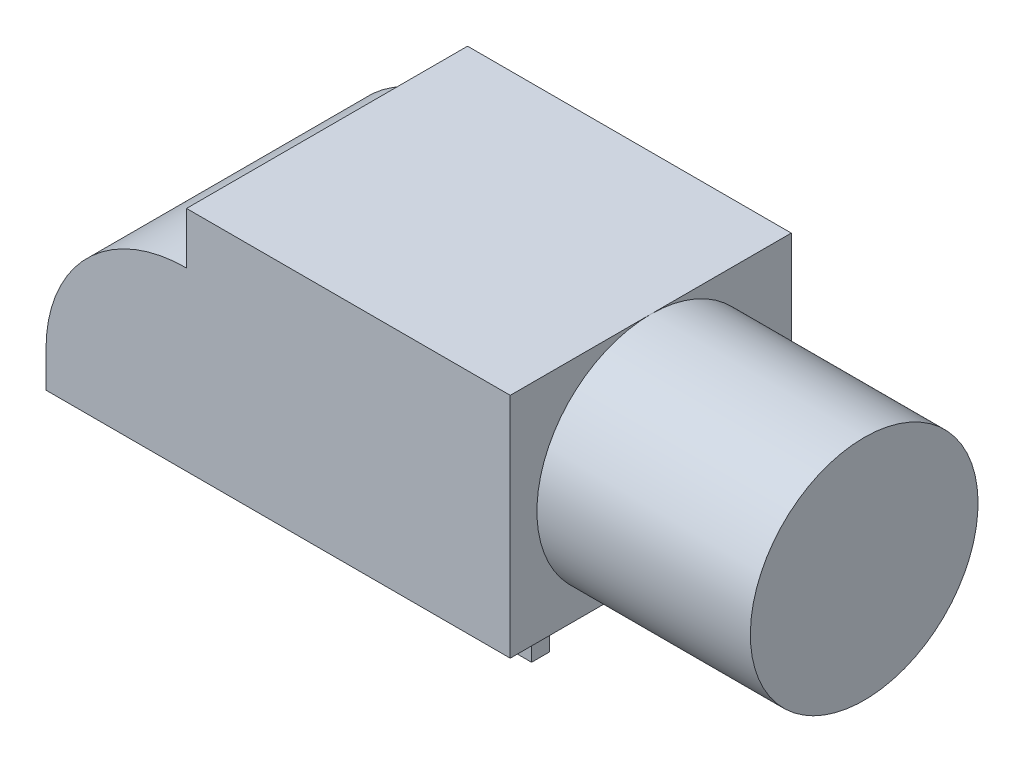
ISO-10303-21;
HEADER;
FILE_DESCRIPTION(('STEP AP214'),'2;1');
FILE_NAME('part.step','',(''),(''),'','','');
FILE_SCHEMA(('AUTOMOTIVE_DESIGN { 1 0 10303 214 1 1 1 1 }'));
ENDSEC;
DATA;
#1=APPLICATION_CONTEXT('core data for automotive mechanical design processes');
#2=APPLICATION_PROTOCOL_DEFINITION('international standard','automotive_design',2000,#1);
#3=PRODUCT_CONTEXT('',#1,'mechanical');
#4=PRODUCT('Part','Part','',(#3));
#5=PRODUCT_RELATED_PRODUCT_CATEGORY('part','',(#4));
#6=PRODUCT_DEFINITION_FORMATION('','',#4);
#7=PRODUCT_DEFINITION_CONTEXT('part definition',#1,'design');
#8=PRODUCT_DEFINITION('design','',#6,#7);
#9=PRODUCT_DEFINITION_SHAPE('','',#8);
#10=(LENGTH_UNIT() NAMED_UNIT(*) SI_UNIT(.MILLI.,.METRE.));
#11=(NAMED_UNIT(*) PLANE_ANGLE_UNIT() SI_UNIT($,.RADIAN.));
#12=(NAMED_UNIT(*) SI_UNIT($,.STERADIAN.) SOLID_ANGLE_UNIT());
#13=UNCERTAINTY_MEASURE_WITH_UNIT(LENGTH_MEASURE(1.E-05),#10,'distance_accuracy_value','');
#14=(GEOMETRIC_REPRESENTATION_CONTEXT(3) GLOBAL_UNCERTAINTY_ASSIGNED_CONTEXT((#13)) GLOBAL_UNIT_ASSIGNED_CONTEXT((#10,
#11,#12)) REPRESENTATION_CONTEXT('',''));
#15=CARTESIAN_POINT('',(0.,0.,0.));
#16=DIRECTION('',(0.,0.,1.));
#17=DIRECTION('',(1.,0.,0.));
#18=AXIS2_PLACEMENT_3D('',#15,#16,#17);
#19=CARTESIAN_POINT('',(-9.525,-3.2,3.95));
#20=DIRECTION('',(0.,1.,0.));
#21=DIRECTION('',(0.,0.,1.));
#22=AXIS2_PLACEMENT_3D('',#19,#20,#21);
#23=PLANE('',#22);
#24=CARTESIAN_POINT('',(-7.875,-3.2,0.));
#25=DIRECTION('',(0.,1.,0.));
#26=DIRECTION('',(0.,0.,1.));
#27=AXIS2_PLACEMENT_3D('',#24,#25,#26);
#28=CIRCLE('',#27,0.75);
#29=CARTESIAN_POINT('',(-7.875,-3.2,0.75));
#30=VERTEX_POINT('',#29);
#31=EDGE_CURVE('E149',#30,#30,#28,.F.);
#32=ORIENTED_EDGE('',*,*,#31,.F.);
#33=EDGE_LOOP('',(#32));
#34=FACE_BOUND('',#33,.T.);
#35=DIRECTION('',(0.,0.,1.));
#36=VECTOR('',#35,1.);
#37=CARTESIAN_POINT('',(2.925,-3.2,2.75));
#38=LINE('',#37,#36);
#39=CARTESIAN_POINT('',(2.925,-3.2,2.25));
#40=VERTEX_POINT('',#39);
#41=CARTESIAN_POINT('',(2.925,-3.2,2.75));
#42=VERTEX_POINT('',#41);
#43=EDGE_CURVE('E193',#40,#42,#38,.T.);
#44=ORIENTED_EDGE('',*,*,#43,.F.);
#45=DIRECTION('',(1.,0.,0.));
#46=VECTOR('',#45,1.);
#47=CARTESIAN_POINT('',(1.725,-3.2,2.25));
#48=LINE('',#47,#46);
#49=CARTESIAN_POINT('',(1.725,-3.2,2.25));
#50=VERTEX_POINT('',#49);
#51=EDGE_CURVE('E238',#50,#40,#48,.T.);
#52=ORIENTED_EDGE('',*,*,#51,.F.);
#53=DIRECTION('',(0.,0.,-1.));
#54=VECTOR('',#53,1.);
#55=CARTESIAN_POINT('',(1.725,-3.2,2.75));
#56=LINE('',#55,#54);
#57=CARTESIAN_POINT('',(1.725,-3.2,2.75));
#58=VERTEX_POINT('',#57);
#59=EDGE_CURVE('E249',#58,#50,#56,.T.);
#60=ORIENTED_EDGE('',*,*,#59,.F.);
#61=DIRECTION('',(-1.,0.,0.));
#62=VECTOR('',#61,1.);
#63=CARTESIAN_POINT('',(1.725,-3.2,2.75));
#64=LINE('',#63,#62);
#65=EDGE_CURVE('E246',#42,#58,#64,.T.);
#66=ORIENTED_EDGE('',*,*,#65,.F.);
#67=EDGE_LOOP('',(#44,#52,#60,#66));
#68=FACE_BOUND('',#67,.T.);
#69=DIRECTION('',(0.,0.,-1.));
#70=VECTOR('',#69,1.);
#71=CARTESIAN_POINT('',(3.525,-3.2,3.95));
#72=LINE('',#71,#70);
#73=CARTESIAN_POINT('',(3.525,-3.2,3.95));
#74=VERTEX_POINT('',#73);
#75=CARTESIAN_POINT('',(3.525,-3.2,0.));
#76=VERTEX_POINT('',#75);
#77=EDGE_CURVE('E197',#74,#76,#72,.T.);
#78=ORIENTED_EDGE('',*,*,#77,.F.);
#79=DIRECTION('',(1.,0.,0.));
#80=VECTOR('',#79,1.);
#81=CARTESIAN_POINT('',(-9.525,-3.2,3.95));
#82=LINE('',#81,#80);
#83=CARTESIAN_POINT('',(-9.525,-3.2,3.95));
#84=VERTEX_POINT('',#83);
#85=EDGE_CURVE('E164',#84,#74,#82,.T.);
#86=ORIENTED_EDGE('',*,*,#85,.F.);
#87=DIRECTION('',(0.,0.,-1.));
#88=VECTOR('',#87,1.);
#89=CARTESIAN_POINT('',(-9.525,-3.2,3.95));
#90=LINE('',#89,#88);
#91=CARTESIAN_POINT('',(-9.525,-3.2,-3.95));
#92=VERTEX_POINT('',#91);
#93=EDGE_CURVE('E162',#84,#92,#90,.T.);
#94=ORIENTED_EDGE('',*,*,#93,.T.);
#95=DIRECTION('',(1.,0.,0.));
#96=VECTOR('',#95,1.);
#97=CARTESIAN_POINT('',(-9.525,-3.2,-3.95));
#98=LINE('',#97,#96);
#99=CARTESIAN_POINT('',(3.525,-3.2,-3.95));
#100=VERTEX_POINT('',#99);
#101=EDGE_CURVE('E168',#92,#100,#98,.T.);
#102=ORIENTED_EDGE('',*,*,#101,.T.);
#103=EDGE_CURVE('E268',#76,#100,#72,.T.);
#104=ORIENTED_EDGE('',*,*,#103,.F.);
#105=EDGE_LOOP('',(#78,#86,#94,#102,#104));
#106=FACE_BOUND('',#105,.T.);
#107=DIRECTION('',(0.,0.,1.));
#108=VECTOR('',#107,1.);
#109=CARTESIAN_POINT('',(2.925,-3.2,-2.25));
#110=LINE('',#109,#108);
#111=CARTESIAN_POINT('',(2.925,-3.2,-2.75));
#112=VERTEX_POINT('',#111);
#113=CARTESIAN_POINT('',(2.925,-3.2,-2.25));
#114=VERTEX_POINT('',#113);
#115=EDGE_CURVE('E199',#112,#114,#110,.T.);
#116=ORIENTED_EDGE('',*,*,#115,.F.);
#117=DIRECTION('',(1.,0.,0.));
#118=VECTOR('',#117,1.);
#119=CARTESIAN_POINT('',(1.725,-3.2,-2.75));
#120=LINE('',#119,#118);
#121=CARTESIAN_POINT('',(1.725,-3.2,-2.75));
#122=VERTEX_POINT('',#121);
#123=EDGE_CURVE('E201',#122,#112,#120,.T.);
#124=ORIENTED_EDGE('',*,*,#123,.F.);
#125=DIRECTION('',(0.,0.,-1.));
#126=VECTOR('',#125,1.);
#127=CARTESIAN_POINT('',(1.725,-3.2,-2.25));
#128=LINE('',#127,#126);
#129=CARTESIAN_POINT('',(1.725,-3.2,-2.25));
#130=VERTEX_POINT('',#129);
#131=EDGE_CURVE('E218',#130,#122,#128,.T.);
#132=ORIENTED_EDGE('',*,*,#131,.F.);
#133=DIRECTION('',(-1.,0.,0.));
#134=VECTOR('',#133,1.);
#135=CARTESIAN_POINT('',(1.725,-3.2,-2.25));
#136=LINE('',#135,#134);
#137=EDGE_CURVE('E60',#114,#130,#136,.T.);
#138=ORIENTED_EDGE('',*,*,#137,.F.);
#139=EDGE_LOOP('',(#116,#124,#132,#138));
#140=FACE_BOUND('',#139,.T.);
#141=ADVANCED_FACE('F37',(#34,#68,#106,#140),#23,.F.);
#142=CARTESIAN_POINT('',(-9.525,3.2,3.95));
#143=DIRECTION('',(0.,-1.,0.));
#144=DIRECTION('',(0.,0.,-1.));
#145=AXIS2_PLACEMENT_3D('',#142,#143,#144);
#146=PLANE('',#145);
#147=DIRECTION('',(-1.,0.,0.));
#148=VECTOR('',#147,1.);
#149=CARTESIAN_POINT('',(-9.525,3.2,-3.95));
#150=LINE('',#149,#148);
#151=CARTESIAN_POINT('',(3.525,3.2,-3.95));
#152=VERTEX_POINT('',#151);
#153=CARTESIAN_POINT('',(-5.575,3.2,-3.95));
#154=VERTEX_POINT('',#153);
#155=EDGE_CURVE('E172',#152,#154,#150,.T.);
#156=ORIENTED_EDGE('',*,*,#155,.T.);
#157=DIRECTION('',(0.,0.,-1.));
#158=VECTOR('',#157,1.);
#159=CARTESIAN_POINT('',(-5.575,3.2,31.3381960203661));
#160=LINE('',#159,#158);
#161=CARTESIAN_POINT('',(-5.575,3.2,3.95));
#162=VERTEX_POINT('',#161);
#163=EDGE_CURVE('E285',#162,#154,#160,.T.);
#164=ORIENTED_EDGE('',*,*,#163,.F.);
#165=DIRECTION('',(-1.,0.,0.));
#166=VECTOR('',#165,1.);
#167=CARTESIAN_POINT('',(-9.525,3.2,3.95));
#168=LINE('',#167,#166);
#169=CARTESIAN_POINT('',(3.525,3.2,3.95));
#170=VERTEX_POINT('',#169);
#171=EDGE_CURVE('E165',#170,#162,#168,.T.);
#172=ORIENTED_EDGE('',*,*,#171,.F.);
#173=DIRECTION('',(0.,0.,1.));
#174=VECTOR('',#173,1.);
#175=CARTESIAN_POINT('',(3.525,3.2,3.95));
#176=LINE('',#175,#174);
#177=CARTESIAN_POINT('',(3.525,3.2,0.));
#178=VERTEX_POINT('',#177);
#179=EDGE_CURVE('E176',#178,#170,#176,.T.);
#180=ORIENTED_EDGE('',*,*,#179,.F.);
#181=EDGE_CURVE('E273',#152,#178,#176,.T.);
#182=ORIENTED_EDGE('',*,*,#181,.F.);
#183=EDGE_LOOP('',(#156,#164,#172,#180,#182));
#184=FACE_BOUND('',#183,.T.);
#185=ADVANCED_FACE('F189',(#184),#146,.F.);
#186=CARTESIAN_POINT('',(0.,0.,3.95));
#187=DIRECTION('',(0.,0.,1.));
#188=DIRECTION('',(1.,0.,0.));
#189=AXIS2_PLACEMENT_3D('',#186,#187,#188);
#190=PLANE('',#189);
#191=DIRECTION('',(0.,1.,0.));
#192=VECTOR('',#191,1.);
#193=CARTESIAN_POINT('',(-5.575,0.,3.95));
#194=LINE('',#193,#192);
#195=CARTESIAN_POINT('',(-5.575,1.75,3.95));
#196=VERTEX_POINT('',#195);
#197=EDGE_CURVE('E158',#196,#162,#194,.T.);
#198=ORIENTED_EDGE('',*,*,#197,.F.);
#199=CARTESIAN_POINT('',(-5.575,-2.2,3.95));
#200=DIRECTION('',(0.,0.,1.));
#201=DIRECTION('',(1.,0.,0.));
#202=AXIS2_PLACEMENT_3D('',#199,#200,#201);
#203=CIRCLE('',#202,3.95);
#204=CARTESIAN_POINT('',(-9.525,-2.2,3.95));
#205=VERTEX_POINT('',#204);
#206=EDGE_CURVE('E144',#205,#196,#203,.F.);
#207=ORIENTED_EDGE('',*,*,#206,.F.);
#208=DIRECTION('',(0.,-1.,0.));
#209=VECTOR('',#208,1.);
#210=CARTESIAN_POINT('',(-9.525,3.2,3.95));
#211=LINE('',#210,#209);
#212=EDGE_CURVE('E155',#205,#84,#211,.T.);
#213=ORIENTED_EDGE('',*,*,#212,.T.);
#214=ORIENTED_EDGE('',*,*,#85,.T.);
#215=DIRECTION('',(0.,1.,0.));
#216=VECTOR('',#215,1.);
#217=CARTESIAN_POINT('',(3.525,0.,3.95));
#218=LINE('',#217,#216);
#219=EDGE_CURVE('E274',#74,#170,#218,.T.);
#220=ORIENTED_EDGE('',*,*,#219,.T.);
#221=ORIENTED_EDGE('',*,*,#171,.T.);
#222=EDGE_LOOP('',(#198,#207,#213,#214,#220,#221));
#223=FACE_BOUND('',#222,.T.);
#224=ADVANCED_FACE('F153',(#223),#190,.T.);
#225=CARTESIAN_POINT('',(0.,0.,-3.95));
#226=DIRECTION('',(0.,0.,1.));
#227=DIRECTION('',(1.,0.,0.));
#228=AXIS2_PLACEMENT_3D('',#225,#226,#227);
#229=PLANE('',#228);
#230=CARTESIAN_POINT('',(-5.575,-2.2,-3.95));
#231=DIRECTION('',(0.,0.,1.));
#232=DIRECTION('',(1.,0.,0.));
#233=AXIS2_PLACEMENT_3D('',#230,#231,#232);
#234=CIRCLE('',#233,3.95);
#235=CARTESIAN_POINT('',(-9.525,-2.2,-3.95));
#236=VERTEX_POINT('',#235);
#237=CARTESIAN_POINT('',(-5.575,1.75,-3.95));
#238=VERTEX_POINT('',#237);
#239=EDGE_CURVE('E52',#236,#238,#234,.F.);
#240=ORIENTED_EDGE('',*,*,#239,.T.);
#241=DIRECTION('',(0.,1.,0.));
#242=VECTOR('',#241,1.);
#243=CARTESIAN_POINT('',(-5.575,0.,-3.95));
#244=LINE('',#243,#242);
#245=EDGE_CURVE('E12',#238,#154,#244,.T.);
#246=ORIENTED_EDGE('',*,*,#245,.T.);
#247=ORIENTED_EDGE('',*,*,#155,.F.);
#248=DIRECTION('',(0.,1.,0.));
#249=VECTOR('',#248,1.);
#250=CARTESIAN_POINT('',(3.525,0.,-3.95));
#251=LINE('',#250,#249);
#252=EDGE_CURVE('E181',#100,#152,#251,.T.);
#253=ORIENTED_EDGE('',*,*,#252,.F.);
#254=ORIENTED_EDGE('',*,*,#101,.F.);
#255=DIRECTION('',(0.,-1.,0.));
#256=VECTOR('',#255,1.);
#257=CARTESIAN_POINT('',(-9.525,3.2,-3.95));
#258=LINE('',#257,#256);
#259=EDGE_CURVE('E175',#236,#92,#258,.T.);
#260=ORIENTED_EDGE('',*,*,#259,.F.);
#261=EDGE_LOOP('',(#240,#246,#247,#253,#254,#260));
#262=FACE_BOUND('',#261,.T.);
#263=ADVANCED_FACE('F354',(#262),#229,.F.);
#264=CARTESIAN_POINT('',(-9.525,3.2,3.95));
#265=DIRECTION('',(1.,0.,0.));
#266=DIRECTION('',(0.,0.,-1.));
#267=AXIS2_PLACEMENT_3D('',#264,#265,#266);
#268=PLANE('',#267);
#269=ORIENTED_EDGE('',*,*,#212,.F.);
#270=DIRECTION('',(0.,0.,-1.));
#271=VECTOR('',#270,1.);
#272=CARTESIAN_POINT('',(-9.525,-2.2,31.3381960203661));
#273=LINE('',#272,#271);
#274=EDGE_CURVE('E45',#205,#236,#273,.T.);
#275=ORIENTED_EDGE('',*,*,#274,.T.);
#276=ORIENTED_EDGE('',*,*,#259,.T.);
#277=ORIENTED_EDGE('',*,*,#93,.F.);
#278=EDGE_LOOP('',(#269,#275,#276,#277));
#279=FACE_BOUND('',#278,.T.);
#280=ADVANCED_FACE('F160',(#279),#268,.F.);
#281=CARTESIAN_POINT('',(3.525,0.,0.));
#282=DIRECTION('',(1.,0.,0.));
#283=DIRECTION('',(0.,1.,0.));
#284=AXIS2_PLACEMENT_3D('',#281,#282,#283);
#285=CYLINDRICAL_SURFACE('',#284,3.2);
#286=CARTESIAN_POINT('',(9.525,0.,0.));
#287=DIRECTION('',(1.,0.,0.));
#288=DIRECTION('',(0.,1.,0.));
#289=AXIS2_PLACEMENT_3D('',#286,#287,#288);
#290=CIRCLE('',#289,3.2);
#291=CARTESIAN_POINT('',(9.525,3.2,0.));
#292=VERTEX_POINT('',#291);
#293=EDGE_CURVE('E264',#292,#292,#290,.T.);
#294=ORIENTED_EDGE('',*,*,#293,.F.);
#295=EDGE_LOOP('',(#294));
#296=FACE_BOUND('',#295,.T.);
#297=CARTESIAN_POINT('',(3.525,0.,0.));
#298=DIRECTION('',(1.,0.,0.));
#299=DIRECTION('',(0.,1.,0.));
#300=AXIS2_PLACEMENT_3D('',#297,#298,#299);
#301=CIRCLE('',#300,3.2);
#302=EDGE_CURVE('E269',#76,#178,#301,.T.);
#303=ORIENTED_EDGE('',*,*,#302,.T.);
#304=EDGE_CURVE('E265',#178,#76,#301,.T.);
#305=ORIENTED_EDGE('',*,*,#304,.T.);
#306=EDGE_LOOP('',(#303,#305));
#307=FACE_BOUND('',#306,.T.);
#308=ADVANCED_FACE('F345',(#296,#307),#285,.T.);
#309=CARTESIAN_POINT('',(3.525,0.,0.));
#310=DIRECTION('',(1.,0.,0.));
#311=DIRECTION('',(0.,1.,0.));
#312=AXIS2_PLACEMENT_3D('',#309,#310,#311);
#313=PLANE('',#312);
#314=ORIENTED_EDGE('',*,*,#179,.T.);
#315=ORIENTED_EDGE('',*,*,#219,.F.);
#316=ORIENTED_EDGE('',*,*,#77,.T.);
#317=ORIENTED_EDGE('',*,*,#304,.F.);
#318=EDGE_LOOP('',(#314,#315,#316,#317));
#319=FACE_BOUND('',#318,.T.);
#320=ADVANCED_FACE('F280',(#319),#313,.T.);
#321=ORIENTED_EDGE('',*,*,#181,.T.);
#322=ORIENTED_EDGE('',*,*,#302,.F.);
#323=ORIENTED_EDGE('',*,*,#103,.T.);
#324=ORIENTED_EDGE('',*,*,#252,.T.);
#325=EDGE_LOOP('',(#321,#322,#323,#324));
#326=FACE_BOUND('',#325,.T.);
#327=ADVANCED_FACE('F351',(#326),#313,.T.);
#328=CARTESIAN_POINT('',(9.525,3.2,3.95));
#329=DIRECTION('',(-1.,0.,0.));
#330=DIRECTION('',(0.,0.,1.));
#331=AXIS2_PLACEMENT_3D('',#328,#329,#330);
#332=PLANE('',#331);
#333=ORIENTED_EDGE('',*,*,#293,.T.);
#334=EDGE_LOOP('',(#333));
#335=FACE_BOUND('',#334,.T.);
#336=ADVANCED_FACE('F39',(#335),#332,.F.);
#337=CARTESIAN_POINT('',(2.925,-4.2,2.75));
#338=DIRECTION('',(-1.,0.,0.));
#339=DIRECTION('',(0.,0.,1.));
#340=AXIS2_PLACEMENT_3D('',#337,#338,#339);
#341=PLANE('',#340);
#342=ORIENTED_EDGE('',*,*,#43,.T.);
#343=DIRECTION('',(0.,1.,0.));
#344=VECTOR('',#343,1.);
#345=CARTESIAN_POINT('',(2.925,-4.2,2.75));
#346=LINE('',#345,#344);
#347=CARTESIAN_POINT('',(2.925,-4.2,2.75));
#348=VERTEX_POINT('',#347);
#349=EDGE_CURVE('E261',#348,#42,#346,.T.);
#350=ORIENTED_EDGE('',*,*,#349,.F.);
#351=DIRECTION('',(0.,0.,1.));
#352=VECTOR('',#351,1.);
#353=CARTESIAN_POINT('',(2.925,-4.2,2.75));
#354=LINE('',#353,#352);
#355=CARTESIAN_POINT('',(2.925,-4.2,2.25));
#356=VERTEX_POINT('',#355);
#357=EDGE_CURVE('E234',#356,#348,#354,.T.);
#358=ORIENTED_EDGE('',*,*,#357,.F.);
#359=DIRECTION('',(0.,1.,0.));
#360=VECTOR('',#359,1.);
#361=CARTESIAN_POINT('',(2.925,-4.2,2.25));
#362=LINE('',#361,#360);
#363=EDGE_CURVE('E244',#356,#40,#362,.T.);
#364=ORIENTED_EDGE('',*,*,#363,.T.);
#365=EDGE_LOOP('',(#342,#350,#358,#364));
#366=FACE_BOUND('',#365,.T.);
#367=ADVANCED_FACE('F340',(#366),#341,.F.);
#368=CARTESIAN_POINT('',(1.725,-4.2,2.75));
#369=DIRECTION('',(0.,0.,-1.));
#370=DIRECTION('',(-1.,0.,0.));
#371=AXIS2_PLACEMENT_3D('',#368,#369,#370);
#372=PLANE('',#371);
#373=ORIENTED_EDGE('',*,*,#65,.T.);
#374=DIRECTION('',(0.,1.,0.));
#375=VECTOR('',#374,1.);
#376=CARTESIAN_POINT('',(1.725,-4.2,2.75));
#377=LINE('',#376,#375);
#378=CARTESIAN_POINT('',(1.725,-4.2,2.75));
#379=VERTEX_POINT('',#378);
#380=EDGE_CURVE('E258',#379,#58,#377,.T.);
#381=ORIENTED_EDGE('',*,*,#380,.F.);
#382=DIRECTION('',(-1.,0.,0.));
#383=VECTOR('',#382,1.);
#384=CARTESIAN_POINT('',(1.725,-4.2,2.75));
#385=LINE('',#384,#383);
#386=EDGE_CURVE('E237',#348,#379,#385,.T.);
#387=ORIENTED_EDGE('',*,*,#386,.F.);
#388=ORIENTED_EDGE('',*,*,#349,.T.);
#389=EDGE_LOOP('',(#373,#381,#387,#388));
#390=FACE_BOUND('',#389,.T.);
#391=ADVANCED_FACE('F336',(#390),#372,.F.);
#392=CARTESIAN_POINT('',(1.725,-4.2,2.75));
#393=DIRECTION('',(1.,0.,0.));
#394=DIRECTION('',(0.,0.,-1.));
#395=AXIS2_PLACEMENT_3D('',#392,#393,#394);
#396=PLANE('',#395);
#397=ORIENTED_EDGE('',*,*,#59,.T.);
#398=DIRECTION('',(0.,1.,0.));
#399=VECTOR('',#398,1.);
#400=CARTESIAN_POINT('',(1.725,-4.2,2.25));
#401=LINE('',#400,#399);
#402=CARTESIAN_POINT('',(1.725,-4.2,2.25));
#403=VERTEX_POINT('',#402);
#404=EDGE_CURVE('E255',#403,#50,#401,.T.);
#405=ORIENTED_EDGE('',*,*,#404,.F.);
#406=DIRECTION('',(0.,0.,-1.));
#407=VECTOR('',#406,1.);
#408=CARTESIAN_POINT('',(1.725,-4.2,2.75));
#409=LINE('',#408,#407);
#410=EDGE_CURVE('E240',#379,#403,#409,.T.);
#411=ORIENTED_EDGE('',*,*,#410,.F.);
#412=ORIENTED_EDGE('',*,*,#380,.T.);
#413=EDGE_LOOP('',(#397,#405,#411,#412));
#414=FACE_BOUND('',#413,.T.);
#415=ADVANCED_FACE('F332',(#414),#396,.F.);
#416=CARTESIAN_POINT('',(1.725,-4.2,2.25));
#417=DIRECTION('',(0.,0.,1.));
#418=DIRECTION('',(1.,0.,0.));
#419=AXIS2_PLACEMENT_3D('',#416,#417,#418);
#420=PLANE('',#419);
#421=ORIENTED_EDGE('',*,*,#51,.T.);
#422=ORIENTED_EDGE('',*,*,#363,.F.);
#423=DIRECTION('',(1.,0.,0.));
#424=VECTOR('',#423,1.);
#425=CARTESIAN_POINT('',(1.725,-4.2,2.25));
#426=LINE('',#425,#424);
#427=EDGE_CURVE('E242',#403,#356,#426,.T.);
#428=ORIENTED_EDGE('',*,*,#427,.F.);
#429=ORIENTED_EDGE('',*,*,#404,.T.);
#430=EDGE_LOOP('',(#421,#422,#428,#429));
#431=FACE_BOUND('',#430,.T.);
#432=ADVANCED_FACE('F328',(#431),#420,.F.);
#433=CARTESIAN_POINT('',(0.,-4.2,0.));
#434=DIRECTION('',(0.,-1.,0.));
#435=DIRECTION('',(0.,0.,-1.));
#436=AXIS2_PLACEMENT_3D('',#433,#434,#435);
#437=PLANE('',#436);
#438=ORIENTED_EDGE('',*,*,#357,.T.);
#439=ORIENTED_EDGE('',*,*,#386,.T.);
#440=ORIENTED_EDGE('',*,*,#410,.T.);
#441=ORIENTED_EDGE('',*,*,#427,.T.);
#442=EDGE_LOOP('',(#438,#439,#440,#441));
#443=FACE_BOUND('',#442,.T.);
#444=ADVANCED_FACE('F325',(#443),#437,.T.);
#445=CARTESIAN_POINT('',(2.925,-4.2,-2.25));
#446=DIRECTION('',(-1.,0.,0.));
#447=DIRECTION('',(0.,0.,1.));
#448=AXIS2_PLACEMENT_3D('',#445,#446,#447);
#449=PLANE('',#448);
#450=ORIENTED_EDGE('',*,*,#115,.T.);
#451=DIRECTION('',(0.,1.,0.));
#452=VECTOR('',#451,1.);
#453=CARTESIAN_POINT('',(2.925,-4.2,-2.25));
#454=LINE('',#453,#452);
#455=CARTESIAN_POINT('',(2.925,-4.2,-2.25));
#456=VERTEX_POINT('',#455);
#457=EDGE_CURVE('E232',#456,#114,#454,.T.);
#458=ORIENTED_EDGE('',*,*,#457,.F.);
#459=DIRECTION('',(0.,0.,1.));
#460=VECTOR('',#459,1.);
#461=CARTESIAN_POINT('',(2.925,-4.2,-2.25));
#462=LINE('',#461,#460);
#463=CARTESIAN_POINT('',(2.925,-4.2,-2.75));
#464=VERTEX_POINT('',#463);
#465=EDGE_CURVE('E217',#464,#456,#462,.T.);
#466=ORIENTED_EDGE('',*,*,#465,.F.);
#467=DIRECTION('',(0.,1.,0.));
#468=VECTOR('',#467,1.);
#469=CARTESIAN_POINT('',(2.925,-4.2,-2.75));
#470=LINE('',#469,#468);
#471=EDGE_CURVE('E213',#464,#112,#470,.T.);
#472=ORIENTED_EDGE('',*,*,#471,.T.);
#473=EDGE_LOOP('',(#450,#458,#466,#472));
#474=FACE_BOUND('',#473,.T.);
#475=ADVANCED_FACE('F220',(#474),#449,.F.);
#476=CARTESIAN_POINT('',(1.725,-4.2,-2.25));
#477=DIRECTION('',(0.,0.,-1.));
#478=DIRECTION('',(-1.,0.,0.));
#479=AXIS2_PLACEMENT_3D('',#476,#477,#478);
#480=PLANE('',#479);
#481=ORIENTED_EDGE('',*,*,#137,.T.);
#482=DIRECTION('',(0.,1.,0.));
#483=VECTOR('',#482,1.);
#484=CARTESIAN_POINT('',(1.725,-4.2,-2.25));
#485=LINE('',#484,#483);
#486=CARTESIAN_POINT('',(1.725,-4.2,-2.25));
#487=VERTEX_POINT('',#486);
#488=EDGE_CURVE('E224',#487,#130,#485,.T.);
#489=ORIENTED_EDGE('',*,*,#488,.F.);
#490=DIRECTION('',(-1.,0.,0.));
#491=VECTOR('',#490,1.);
#492=CARTESIAN_POINT('',(1.725,-4.2,-2.25));
#493=LINE('',#492,#491);
#494=EDGE_CURVE('E296',#456,#487,#493,.T.);
#495=ORIENTED_EDGE('',*,*,#494,.F.);
#496=ORIENTED_EDGE('',*,*,#457,.T.);
#497=EDGE_LOOP('',(#481,#489,#495,#496));
#498=FACE_BOUND('',#497,.T.);
#499=ADVANCED_FACE('F304',(#498),#480,.F.);
#500=CARTESIAN_POINT('',(1.725,-4.2,-2.25));
#501=DIRECTION('',(1.,0.,0.));
#502=DIRECTION('',(0.,0.,-1.));
#503=AXIS2_PLACEMENT_3D('',#500,#501,#502);
#504=PLANE('',#503);
#505=ORIENTED_EDGE('',*,*,#131,.T.);
#506=DIRECTION('',(0.,1.,0.));
#507=VECTOR('',#506,1.);
#508=CARTESIAN_POINT('',(1.725,-4.2,-2.75));
#509=LINE('',#508,#507);
#510=CARTESIAN_POINT('',(1.725,-4.2,-2.75));
#511=VERTEX_POINT('',#510);
#512=EDGE_CURVE('E216',#511,#122,#509,.T.);
#513=ORIENTED_EDGE('',*,*,#512,.F.);
#514=DIRECTION('',(0.,0.,-1.));
#515=VECTOR('',#514,1.);
#516=CARTESIAN_POINT('',(1.725,-4.2,-2.25));
#517=LINE('',#516,#515);
#518=EDGE_CURVE('E226',#487,#511,#517,.T.);
#519=ORIENTED_EDGE('',*,*,#518,.F.);
#520=ORIENTED_EDGE('',*,*,#488,.T.);
#521=EDGE_LOOP('',(#505,#513,#519,#520));
#522=FACE_BOUND('',#521,.T.);
#523=ADVANCED_FACE('F300',(#522),#504,.F.);
#524=CARTESIAN_POINT('',(1.725,-4.2,-2.75));
#525=DIRECTION('',(0.,0.,1.));
#526=DIRECTION('',(1.,0.,0.));
#527=AXIS2_PLACEMENT_3D('',#524,#525,#526);
#528=PLANE('',#527);
#529=ORIENTED_EDGE('',*,*,#123,.T.);
#530=ORIENTED_EDGE('',*,*,#471,.F.);
#531=DIRECTION('',(1.,0.,0.));
#532=VECTOR('',#531,1.);
#533=CARTESIAN_POINT('',(1.725,-4.2,-2.75));
#534=LINE('',#533,#532);
#535=EDGE_CURVE('E222',#511,#464,#534,.T.);
#536=ORIENTED_EDGE('',*,*,#535,.F.);
#537=ORIENTED_EDGE('',*,*,#512,.T.);
#538=EDGE_LOOP('',(#529,#530,#536,#537));
#539=FACE_BOUND('',#538,.T.);
#540=ADVANCED_FACE('F211',(#539),#528,.F.);
#541=CARTESIAN_POINT('',(0.,-4.2,0.));
#542=DIRECTION('',(0.,-1.,0.));
#543=DIRECTION('',(0.,0.,-1.));
#544=AXIS2_PLACEMENT_3D('',#541,#542,#543);
#545=PLANE('',#544);
#546=ORIENTED_EDGE('',*,*,#465,.T.);
#547=ORIENTED_EDGE('',*,*,#494,.T.);
#548=ORIENTED_EDGE('',*,*,#518,.T.);
#549=ORIENTED_EDGE('',*,*,#535,.T.);
#550=EDGE_LOOP('',(#546,#547,#548,#549));
#551=FACE_BOUND('',#550,.T.);
#552=ADVANCED_FACE('F306',(#551),#545,.T.);
#553=CARTESIAN_POINT('',(-7.875,-4.2,0.));
#554=DIRECTION('',(0.,1.,0.));
#555=DIRECTION('',(0.,0.,1.));
#556=AXIS2_PLACEMENT_3D('',#553,#554,#555);
#557=CYLINDRICAL_SURFACE('',#556,0.75);
#558=CARTESIAN_POINT('',(-7.875,-4.2,0.));
#559=DIRECTION('',(0.,-1.,0.));
#560=DIRECTION('',(0.,0.,-1.));
#561=AXIS2_PLACEMENT_3D('',#558,#559,#560);
#562=CIRCLE('',#561,0.75);
#563=CARTESIAN_POINT('',(-7.875,-4.2,-0.75));
#564=VERTEX_POINT('',#563);
#565=EDGE_CURVE('E206',#564,#564,#562,.T.);
#566=ORIENTED_EDGE('',*,*,#565,.F.);
#567=EDGE_LOOP('',(#566));
#568=FACE_BOUND('',#567,.T.);
#569=ORIENTED_EDGE('',*,*,#31,.T.);
#570=EDGE_LOOP('',(#569));
#571=FACE_BOUND('',#570,.T.);
#572=ADVANCED_FACE('F185',(#568,#571),#557,.T.);
#573=CARTESIAN_POINT('',(-7.875,-4.2,0.));
#574=DIRECTION('',(0.,-1.,0.));
#575=DIRECTION('',(0.,0.,-1.));
#576=AXIS2_PLACEMENT_3D('',#573,#574,#575);
#577=PLANE('',#576);
#578=ORIENTED_EDGE('',*,*,#565,.T.);
#579=EDGE_LOOP('',(#578));
#580=FACE_BOUND('',#579,.T.);
#581=ADVANCED_FACE('F313',(#580),#577,.T.);
#582=CARTESIAN_POINT('',(-5.575,3.2,31.3381960203661));
#583=DIRECTION('',(1.,0.,0.));
#584=DIRECTION('',(0.,1.,0.));
#585=AXIS2_PLACEMENT_3D('',#582,#583,#584);
#586=PLANE('',#585);
#587=DIRECTION('',(0.,0.,-1.));
#588=VECTOR('',#587,1.);
#589=CARTESIAN_POINT('',(-5.575,1.75,31.3381960203661));
#590=LINE('',#589,#588);
#591=EDGE_CURVE('E287',#196,#238,#590,.T.);
#592=ORIENTED_EDGE('',*,*,#591,.F.);
#593=ORIENTED_EDGE('',*,*,#197,.T.);
#594=ORIENTED_EDGE('',*,*,#163,.T.);
#595=ORIENTED_EDGE('',*,*,#245,.F.);
#596=EDGE_LOOP('',(#592,#593,#594,#595));
#597=FACE_BOUND('',#596,.T.);
#598=ADVANCED_FACE('F451',(#597),#586,.F.);
#599=CARTESIAN_POINT('',(-5.575,-2.2,31.3381960203661));
#600=DIRECTION('',(0.,0.,-1.));
#601=DIRECTION('',(-1.,0.,0.));
#602=AXIS2_PLACEMENT_3D('',#599,#600,#601);
#603=CYLINDRICAL_SURFACE('',#602,3.95);
#604=ORIENTED_EDGE('',*,*,#274,.F.);
#605=ORIENTED_EDGE('',*,*,#206,.T.);
#606=ORIENTED_EDGE('',*,*,#591,.T.);
#607=ORIENTED_EDGE('',*,*,#239,.F.);
#608=EDGE_LOOP('',(#604,#605,#606,#607));
#609=FACE_BOUND('',#608,.T.);
#610=ADVANCED_FACE('F143',(#609),#603,.T.);
#611=CLOSED_SHELL('',(#141,#185,#224,#263,#280,#308,#320,#327,#336,#367,#391,#415,#432,#444,
#475,#499,#523,#540,#552,#572,#581,#598,#610));
#612=MANIFOLD_SOLID_BREP('B2',#611);
#613=ADVANCED_BREP_SHAPE_REPRESENTATION('',(#18,#612),#14);
#614=SHAPE_DEFINITION_REPRESENTATION(#9,#613);
ENDSEC;
END-ISO-10303-21;
